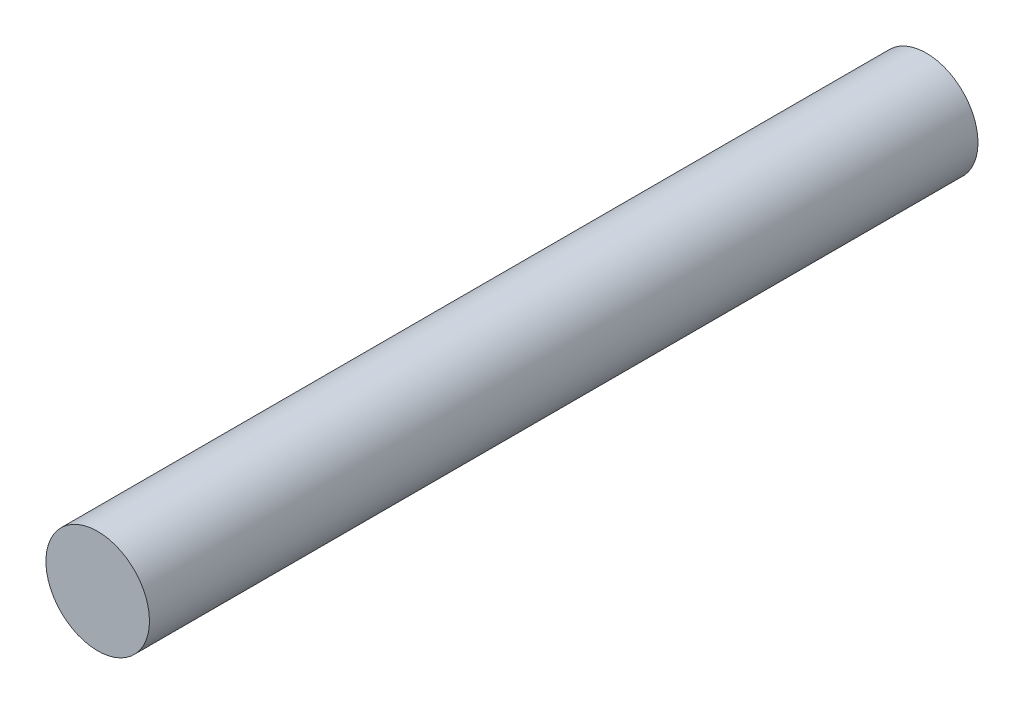
ISO-10303-21;
HEADER;
FILE_DESCRIPTION(('STEP AP214'),'2;1');
FILE_NAME('part.step','',(''),(''),'','','');
FILE_SCHEMA(('AUTOMOTIVE_DESIGN { 1 0 10303 214 1 1 1 1 }'));
ENDSEC;
DATA;
#1=APPLICATION_CONTEXT('core data for automotive mechanical design processes');
#2=APPLICATION_PROTOCOL_DEFINITION('international standard','automotive_design',2000,#1);
#3=PRODUCT_CONTEXT('',#1,'mechanical');
#4=PRODUCT('Part','Part','',(#3));
#5=PRODUCT_RELATED_PRODUCT_CATEGORY('part','',(#4));
#6=PRODUCT_DEFINITION_FORMATION('','',#4);
#7=PRODUCT_DEFINITION_CONTEXT('part definition',#1,'design');
#8=PRODUCT_DEFINITION('design','',#6,#7);
#9=PRODUCT_DEFINITION_SHAPE('','',#8);
#10=(LENGTH_UNIT() NAMED_UNIT(*) SI_UNIT(.MILLI.,.METRE.));
#11=(NAMED_UNIT(*) PLANE_ANGLE_UNIT() SI_UNIT($,.RADIAN.));
#12=(NAMED_UNIT(*) SI_UNIT($,.STERADIAN.) SOLID_ANGLE_UNIT());
#13=UNCERTAINTY_MEASURE_WITH_UNIT(LENGTH_MEASURE(1.E-05),#10,'distance_accuracy_value','');
#14=(GEOMETRIC_REPRESENTATION_CONTEXT(3) GLOBAL_UNCERTAINTY_ASSIGNED_CONTEXT((#13)) GLOBAL_UNIT_ASSIGNED_CONTEXT((#10,
#11,#12)) REPRESENTATION_CONTEXT('',''));
#15=CARTESIAN_POINT('',(0.,0.,0.));
#16=DIRECTION('',(0.,0.,1.));
#17=DIRECTION('',(1.,0.,0.));
#18=AXIS2_PLACEMENT_3D('',#15,#16,#17);
#19=CARTESIAN_POINT('',(0.,0.,40.));
#20=DIRECTION('',(0.,0.,-1.));
#21=DIRECTION('',(-1.,0.,0.));
#22=AXIS2_PLACEMENT_3D('',#19,#20,#21);
#23=CYLINDRICAL_SURFACE('',#22,2.5);
#24=CARTESIAN_POINT('',(0.,0.,40.));
#25=DIRECTION('',(0.,0.,1.));
#26=DIRECTION('',(1.,0.,0.));
#27=AXIS2_PLACEMENT_3D('',#24,#25,#26);
#28=CIRCLE('',#27,2.5);
#29=CARTESIAN_POINT('',(2.5,0.,40.));
#30=VERTEX_POINT('',#29);
#31=EDGE_CURVE('E10',#30,#30,#28,.T.);
#32=ORIENTED_EDGE('',*,*,#31,.F.);
#33=EDGE_LOOP('',(#32));
#34=FACE_BOUND('',#33,.T.);
#35=CARTESIAN_POINT('',(0.,0.,0.));
#36=DIRECTION('',(0.,0.,1.));
#37=DIRECTION('',(1.,0.,0.));
#38=AXIS2_PLACEMENT_3D('',#35,#36,#37);
#39=CIRCLE('',#38,2.5);
#40=CARTESIAN_POINT('',(2.5,0.,0.));
#41=VERTEX_POINT('',#40);
#42=EDGE_CURVE('E36',#41,#41,#39,.T.);
#43=ORIENTED_EDGE('',*,*,#42,.T.);
#44=EDGE_LOOP('',(#43));
#45=FACE_BOUND('',#44,.T.);
#46=ADVANCED_FACE('F33',(#34,#45),#23,.T.);
#47=CARTESIAN_POINT('',(0.,0.,40.));
#48=DIRECTION('',(0.,0.,1.));
#49=DIRECTION('',(1.,0.,0.));
#50=AXIS2_PLACEMENT_3D('',#47,#48,#49);
#51=PLANE('',#50);
#52=ORIENTED_EDGE('',*,*,#31,.T.);
#53=EDGE_LOOP('',(#52));
#54=FACE_BOUND('',#53,.T.);
#55=ADVANCED_FACE('F48',(#54),#51,.T.);
#56=CARTESIAN_POINT('',(0.,0.,0.));
#57=DIRECTION('',(0.,0.,1.));
#58=DIRECTION('',(1.,0.,0.));
#59=AXIS2_PLACEMENT_3D('',#56,#57,#58);
#60=PLANE('',#59);
#61=ORIENTED_EDGE('',*,*,#42,.F.);
#62=EDGE_LOOP('',(#61));
#63=FACE_BOUND('',#62,.T.);
#64=ADVANCED_FACE('F46',(#63),#60,.F.);
#65=CLOSED_SHELL('',(#46,#55,#64));
#66=MANIFOLD_SOLID_BREP('B2',#65);
#67=ADVANCED_BREP_SHAPE_REPRESENTATION('',(#18,#66),#14);
#68=SHAPE_DEFINITION_REPRESENTATION(#9,#67);
ENDSEC;
END-ISO-10303-21;
